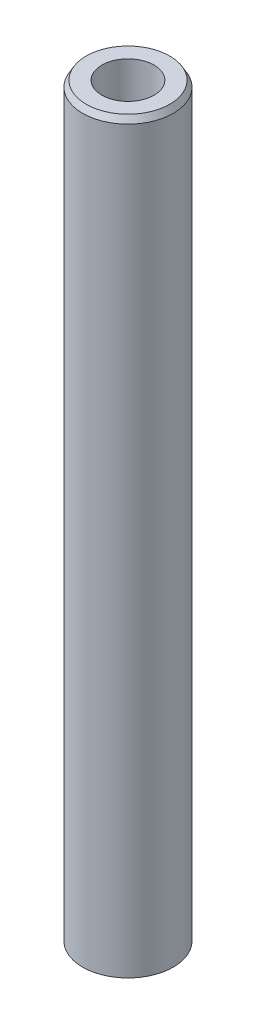
ISO-10303-21;
HEADER;
FILE_DESCRIPTION(('STEP AP214'),'2;1');
FILE_NAME('part.step','',(''),(''),'','','');
FILE_SCHEMA(('AUTOMOTIVE_DESIGN { 1 0 10303 214 1 1 1 1 }'));
ENDSEC;
DATA;
#1=APPLICATION_CONTEXT('core data for automotive mechanical design processes');
#2=APPLICATION_PROTOCOL_DEFINITION('international standard','automotive_design',2000,#1);
#3=PRODUCT_CONTEXT('',#1,'mechanical');
#4=PRODUCT('Part','Part','',(#3));
#5=PRODUCT_RELATED_PRODUCT_CATEGORY('part','',(#4));
#6=PRODUCT_DEFINITION_FORMATION('','',#4);
#7=PRODUCT_DEFINITION_CONTEXT('part definition',#1,'design');
#8=PRODUCT_DEFINITION('design','',#6,#7);
#9=PRODUCT_DEFINITION_SHAPE('','',#8);
#10=(LENGTH_UNIT() NAMED_UNIT(*) SI_UNIT(.MILLI.,.METRE.));
#11=(NAMED_UNIT(*) PLANE_ANGLE_UNIT() SI_UNIT($,.RADIAN.));
#12=(NAMED_UNIT(*) SI_UNIT($,.STERADIAN.) SOLID_ANGLE_UNIT());
#13=UNCERTAINTY_MEASURE_WITH_UNIT(LENGTH_MEASURE(1.E-05),#10,'distance_accuracy_value','');
#14=(GEOMETRIC_REPRESENTATION_CONTEXT(3) GLOBAL_UNCERTAINTY_ASSIGNED_CONTEXT((#13)) GLOBAL_UNIT_ASSIGNED_CONTEXT((#10,
#11,#12)) REPRESENTATION_CONTEXT('',''));
#15=CARTESIAN_POINT('',(0.,0.,0.));
#16=DIRECTION('',(0.,0.,1.));
#17=DIRECTION('',(1.,0.,0.));
#18=AXIS2_PLACEMENT_3D('',#15,#16,#17);
#19=CARTESIAN_POINT('',(0.,537.153292802748,0.));
#20=DIRECTION('',(0.,-1.,0.));
#21=DIRECTION('',(0.,0.,-1.));
#22=AXIS2_PLACEMENT_3D('',#19,#20,#21);
#23=CYLINDRICAL_SURFACE('',#22,32.5);
#24=CARTESIAN_POINT('',(0.,532.772852797806,0.));
#25=DIRECTION('',(0.,1.,0.));
#26=DIRECTION('',(0.,0.,1.));
#27=AXIS2_PLACEMENT_3D('',#24,#25,#26);
#28=CIRCLE('',#27,32.5);
#29=CARTESIAN_POINT('',(0.,532.772852797806,32.5));
#30=VERTEX_POINT('',#29);
#31=EDGE_CURVE('E50',#30,#30,#28,.F.);
#32=ORIENTED_EDGE('',*,*,#31,.T.);
#33=EDGE_LOOP('',(#32));
#34=FACE_BOUND('',#33,.T.);
#35=CARTESIAN_POINT('',(0.,2.52904821602229,0.));
#36=DIRECTION('',(0.,1.,0.));
#37=DIRECTION('',(0.,0.,1.));
#38=AXIS2_PLACEMENT_3D('',#35,#36,#37);
#39=CIRCLE('',#38,32.5);
#40=CARTESIAN_POINT('',(0.,2.52904821602229,32.5));
#41=VERTEX_POINT('',#40);
#42=EDGE_CURVE('E51',#41,#41,#39,.T.);
#43=ORIENTED_EDGE('',*,*,#42,.T.);
#44=EDGE_LOOP('',(#43));
#45=FACE_BOUND('',#44,.T.);
#46=ADVANCED_FACE('F39',(#34,#45),#23,.T.);
#47=CARTESIAN_POINT('',(0.,537.153292802748,0.));
#48=DIRECTION('',(0.,1.,0.));
#49=DIRECTION('',(0.,0.,1.));
#50=AXIS2_PLACEMENT_3D('',#47,#48,#49);
#51=PLANE('',#50);
#52=CARTESIAN_POINT('',(0.,537.153292802748,0.));
#53=DIRECTION('',(0.,1.,0.));
#54=DIRECTION('',(0.,0.,1.));
#55=AXIS2_PLACEMENT_3D('',#52,#53,#54);
#56=CIRCLE('',#55,29.9709517839778);
#57=CARTESIAN_POINT('',(0.,537.153292802748,29.9709517839778));
#58=VERTEX_POINT('',#57);
#59=EDGE_CURVE('E54',#58,#58,#56,.T.);
#60=ORIENTED_EDGE('',*,*,#59,.T.);
#61=EDGE_LOOP('',(#60));
#62=FACE_BOUND('',#61,.T.);
#63=CARTESIAN_POINT('',(0.,537.153292802748,0.));
#64=DIRECTION('',(0.,1.,0.));
#65=DIRECTION('',(0.,0.,1.));
#66=AXIS2_PLACEMENT_3D('',#63,#64,#65);
#67=CIRCLE('',#66,18.7209981379299);
#68=CARTESIAN_POINT('',(0.,537.153292802748,18.7209981379299));
#69=VERTEX_POINT('',#68);
#70=EDGE_CURVE('E58',#69,#69,#67,.T.);
#71=ORIENTED_EDGE('',*,*,#70,.F.);
#72=EDGE_LOOP('',(#71));
#73=FACE_BOUND('',#72,.T.);
#74=ADVANCED_FACE('F69',(#62,#73),#51,.T.);
#75=CARTESIAN_POINT('',(0.,0.,0.));
#76=DIRECTION('',(0.,1.,0.));
#77=DIRECTION('',(0.,0.,1.));
#78=AXIS2_PLACEMENT_3D('',#75,#76,#77);
#79=PLANE('',#78);
#80=CARTESIAN_POINT('',(0.,0.,0.));
#81=DIRECTION('',(0.,1.,0.));
#82=DIRECTION('',(0.,0.,1.));
#83=AXIS2_PLACEMENT_3D('',#80,#81,#82);
#84=CIRCLE('',#83,28.1195599950579);
#85=CARTESIAN_POINT('',(0.,0.,28.1195599950579));
#86=VERTEX_POINT('',#85);
#87=EDGE_CURVE('E10',#86,#86,#84,.F.);
#88=ORIENTED_EDGE('',*,*,#87,.T.);
#89=EDGE_LOOP('',(#88));
#90=FACE_BOUND('',#89,.T.);
#91=CARTESIAN_POINT('',(0.,0.,0.));
#92=DIRECTION('',(0.,1.,0.));
#93=DIRECTION('',(0.,0.,1.));
#94=AXIS2_PLACEMENT_3D('',#91,#92,#93);
#95=CIRCLE('',#94,18.7209981379299);
#96=CARTESIAN_POINT('',(0.,0.,18.7209981379299));
#97=VERTEX_POINT('',#96);
#98=EDGE_CURVE('E63',#97,#97,#95,.T.);
#99=ORIENTED_EDGE('',*,*,#98,.T.);
#100=EDGE_LOOP('',(#99));
#101=FACE_BOUND('',#100,.T.);
#102=ADVANCED_FACE('F75',(#90,#101),#79,.F.);
#103=CARTESIAN_POINT('',(0.,537.153292802748,0.));
#104=DIRECTION('',(0.,-1.,0.));
#105=DIRECTION('',(0.,0.,-1.));
#106=AXIS2_PLACEMENT_3D('',#103,#104,#105);
#107=CYLINDRICAL_SURFACE('',#106,18.7209981379299);
#108=ORIENTED_EDGE('',*,*,#70,.T.);
#109=EDGE_LOOP('',(#108));
#110=FACE_BOUND('',#109,.T.);
#111=ORIENTED_EDGE('',*,*,#98,.F.);
#112=EDGE_LOOP('',(#111));
#113=FACE_BOUND('',#112,.T.);
#114=ADVANCED_FACE('F70',(#110,#113),#107,.F.);
#115=CARTESIAN_POINT('',(0.,537.153292802748,0.));
#116=DIRECTION('',(0.,-1.,0.));
#117=DIRECTION('',(0.,0.,-1.));
#118=AXIS2_PLACEMENT_3D('',#115,#116,#117);
#119=CONICAL_SURFACE('',#118,29.9709517839778,0.523598775598281);
#120=ORIENTED_EDGE('',*,*,#31,.F.);
#121=EDGE_LOOP('',(#120));
#122=FACE_BOUND('',#121,.T.);
#123=ORIENTED_EDGE('',*,*,#59,.F.);
#124=EDGE_LOOP('',(#123));
#125=FACE_BOUND('',#124,.T.);
#126=ADVANCED_FACE('F81',(#122,#125),#119,.T.);
#127=CARTESIAN_POINT('',(0.,2.52904821602229,0.));
#128=DIRECTION('',(0.,1.,0.));
#129=DIRECTION('',(0.,0.,1.));
#130=AXIS2_PLACEMENT_3D('',#127,#128,#129);
#131=CONICAL_SURFACE('',#130,32.5,1.04719755119661);
#132=ORIENTED_EDGE('',*,*,#87,.F.);
#133=EDGE_LOOP('',(#132));
#134=FACE_BOUND('',#133,.T.);
#135=ORIENTED_EDGE('',*,*,#42,.F.);
#136=EDGE_LOOP('',(#135));
#137=FACE_BOUND('',#136,.T.);
#138=ADVANCED_FACE('F45',(#134,#137),#131,.T.);
#139=CLOSED_SHELL('',(#46,#74,#102,#114,#126,#138));
#140=MANIFOLD_SOLID_BREP('B2',#139);
#141=ADVANCED_BREP_SHAPE_REPRESENTATION('',(#18,#140),#14);
#142=SHAPE_DEFINITION_REPRESENTATION(#9,#141);
ENDSEC;
END-ISO-10303-21;
